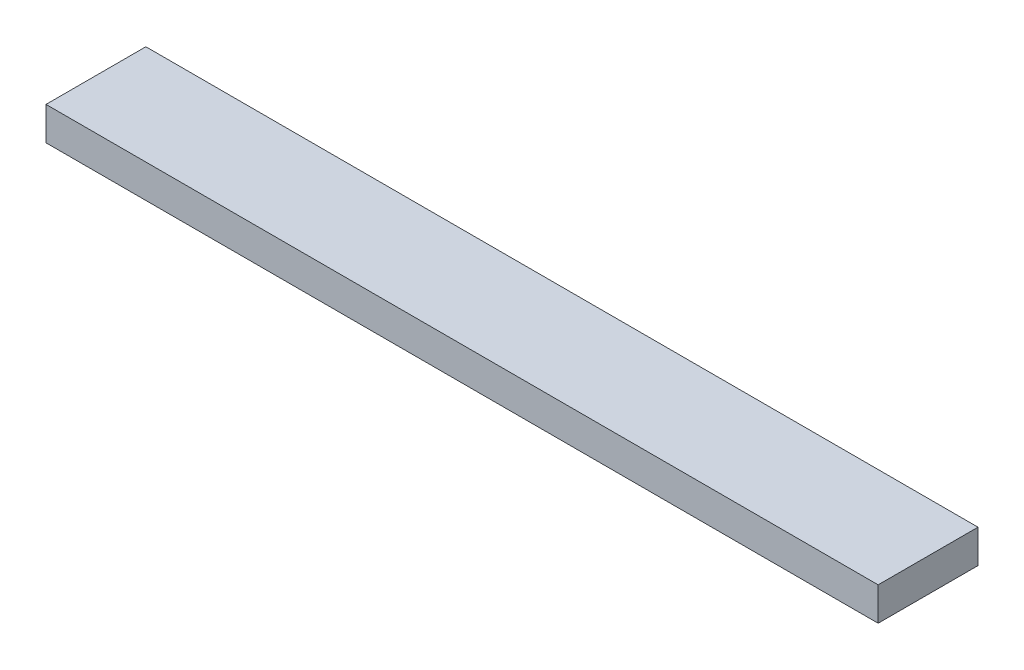
ISO-10303-21;
HEADER;
FILE_DESCRIPTION(('STEP AP214'),'2;1');
FILE_NAME('part.step','',(''),(''),'','','');
FILE_SCHEMA(('AUTOMOTIVE_DESIGN { 1 0 10303 214 1 1 1 1 }'));
ENDSEC;
DATA;
#1=APPLICATION_CONTEXT('core data for automotive mechanical design processes');
#2=APPLICATION_PROTOCOL_DEFINITION('international standard','automotive_design',2000,#1);
#3=PRODUCT_CONTEXT('',#1,'mechanical');
#4=PRODUCT('Part','Part','',(#3));
#5=PRODUCT_RELATED_PRODUCT_CATEGORY('part','',(#4));
#6=PRODUCT_DEFINITION_FORMATION('','',#4);
#7=PRODUCT_DEFINITION_CONTEXT('part definition',#1,'design');
#8=PRODUCT_DEFINITION('design','',#6,#7);
#9=PRODUCT_DEFINITION_SHAPE('','',#8);
#10=(LENGTH_UNIT() NAMED_UNIT(*) SI_UNIT(.MILLI.,.METRE.));
#11=(NAMED_UNIT(*) PLANE_ANGLE_UNIT() SI_UNIT($,.RADIAN.));
#12=(NAMED_UNIT(*) SI_UNIT($,.STERADIAN.) SOLID_ANGLE_UNIT());
#13=UNCERTAINTY_MEASURE_WITH_UNIT(LENGTH_MEASURE(1.E-05),#10,'distance_accuracy_value','');
#14=(GEOMETRIC_REPRESENTATION_CONTEXT(3) GLOBAL_UNCERTAINTY_ASSIGNED_CONTEXT((#13)) GLOBAL_UNIT_ASSIGNED_CONTEXT((#10,
#11,#12)) REPRESENTATION_CONTEXT('',''));
#15=CARTESIAN_POINT('',(0.,0.,0.));
#16=DIRECTION('',(0.,0.,1.));
#17=DIRECTION('',(1.,0.,0.));
#18=AXIS2_PLACEMENT_3D('',#15,#16,#17);
#19=CARTESIAN_POINT('',(250.,20.,30.));
#20=DIRECTION('',(-1.,0.,0.));
#21=DIRECTION('',(0.,0.,1.));
#22=AXIS2_PLACEMENT_3D('',#19,#20,#21);
#23=PLANE('',#22);
#24=DIRECTION('',(0.,0.,-1.));
#25=VECTOR('',#24,1.);
#26=CARTESIAN_POINT('',(250.,0.,30.));
#27=LINE('',#26,#25);
#28=CARTESIAN_POINT('',(250.,0.,30.));
#29=VERTEX_POINT('',#28);
#30=CARTESIAN_POINT('',(250.,0.,-30.));
#31=VERTEX_POINT('',#30);
#32=EDGE_CURVE('E98',#29,#31,#27,.T.);
#33=ORIENTED_EDGE('',*,*,#32,.T.);
#34=DIRECTION('',(0.,-1.,0.));
#35=VECTOR('',#34,1.);
#36=CARTESIAN_POINT('',(250.,20.,-30.));
#37=LINE('',#36,#35);
#38=CARTESIAN_POINT('',(250.,20.,-30.));
#39=VERTEX_POINT('',#38);
#40=EDGE_CURVE('E11',#39,#31,#37,.T.);
#41=ORIENTED_EDGE('',*,*,#40,.F.);
#42=DIRECTION('',(0.,0.,-1.));
#43=VECTOR('',#42,1.);
#44=CARTESIAN_POINT('',(250.,20.,30.));
#45=LINE('',#44,#43);
#46=CARTESIAN_POINT('',(250.,20.,30.));
#47=VERTEX_POINT('',#46);
#48=EDGE_CURVE('E86',#47,#39,#45,.T.);
#49=ORIENTED_EDGE('',*,*,#48,.F.);
#50=DIRECTION('',(0.,-1.,0.));
#51=VECTOR('',#50,1.);
#52=CARTESIAN_POINT('',(250.,20.,30.));
#53=LINE('',#52,#51);
#54=EDGE_CURVE('E94',#47,#29,#53,.T.);
#55=ORIENTED_EDGE('',*,*,#54,.T.);
#56=EDGE_LOOP('',(#33,#41,#49,#55));
#57=FACE_BOUND('',#56,.T.);
#58=ADVANCED_FACE('F35',(#57),#23,.F.);
#59=CARTESIAN_POINT('',(-250.,20.,-30.));
#60=DIRECTION('',(0.,0.,1.));
#61=DIRECTION('',(1.,0.,0.));
#62=AXIS2_PLACEMENT_3D('',#59,#60,#61);
#63=PLANE('',#62);
#64=DIRECTION('',(-1.,0.,0.));
#65=VECTOR('',#64,1.);
#66=CARTESIAN_POINT('',(-250.,0.,-30.));
#67=LINE('',#66,#65);
#68=CARTESIAN_POINT('',(-250.,0.,-30.));
#69=VERTEX_POINT('',#68);
#70=EDGE_CURVE('E90',#31,#69,#67,.T.);
#71=ORIENTED_EDGE('',*,*,#70,.T.);
#72=DIRECTION('',(0.,-1.,0.));
#73=VECTOR('',#72,1.);
#74=CARTESIAN_POINT('',(-250.,20.,-30.));
#75=LINE('',#74,#73);
#76=CARTESIAN_POINT('',(-250.,20.,-30.));
#77=VERTEX_POINT('',#76);
#78=EDGE_CURVE('E43',#77,#69,#75,.T.);
#79=ORIENTED_EDGE('',*,*,#78,.F.);
#80=DIRECTION('',(-1.,0.,0.));
#81=VECTOR('',#80,1.);
#82=CARTESIAN_POINT('',(-250.,20.,-30.));
#83=LINE('',#82,#81);
#84=EDGE_CURVE('E81',#39,#77,#83,.T.);
#85=ORIENTED_EDGE('',*,*,#84,.F.);
#86=ORIENTED_EDGE('',*,*,#40,.T.);
#87=EDGE_LOOP('',(#71,#79,#85,#86));
#88=FACE_BOUND('',#87,.T.);
#89=ADVANCED_FACE('F89',(#88),#63,.F.);
#90=CARTESIAN_POINT('',(-250.,20.,30.));
#91=DIRECTION('',(1.,0.,0.));
#92=DIRECTION('',(0.,0.,-1.));
#93=AXIS2_PLACEMENT_3D('',#90,#91,#92);
#94=PLANE('',#93);
#95=DIRECTION('',(0.,0.,1.));
#96=VECTOR('',#95,1.);
#97=CARTESIAN_POINT('',(-250.,0.,30.));
#98=LINE('',#97,#96);
#99=CARTESIAN_POINT('',(-250.,0.,30.));
#100=VERTEX_POINT('',#99);
#101=EDGE_CURVE('E68',#69,#100,#98,.T.);
#102=ORIENTED_EDGE('',*,*,#101,.T.);
#103=DIRECTION('',(0.,-1.,0.));
#104=VECTOR('',#103,1.);
#105=CARTESIAN_POINT('',(-250.,20.,30.));
#106=LINE('',#105,#104);
#107=CARTESIAN_POINT('',(-250.,20.,30.));
#108=VERTEX_POINT('',#107);
#109=EDGE_CURVE('E91',#108,#100,#106,.T.);
#110=ORIENTED_EDGE('',*,*,#109,.F.);
#111=DIRECTION('',(0.,0.,1.));
#112=VECTOR('',#111,1.);
#113=CARTESIAN_POINT('',(-250.,20.,30.));
#114=LINE('',#113,#112);
#115=EDGE_CURVE('E84',#77,#108,#114,.T.);
#116=ORIENTED_EDGE('',*,*,#115,.F.);
#117=ORIENTED_EDGE('',*,*,#78,.T.);
#118=EDGE_LOOP('',(#102,#110,#116,#117));
#119=FACE_BOUND('',#118,.T.);
#120=ADVANCED_FACE('F92',(#119),#94,.F.);
#121=CARTESIAN_POINT('',(-250.,20.,30.));
#122=DIRECTION('',(0.,0.,-1.));
#123=DIRECTION('',(-1.,0.,0.));
#124=AXIS2_PLACEMENT_3D('',#121,#122,#123);
#125=PLANE('',#124);
#126=DIRECTION('',(1.,0.,0.));
#127=VECTOR('',#126,1.);
#128=CARTESIAN_POINT('',(-250.,0.,30.));
#129=LINE('',#128,#127);
#130=EDGE_CURVE('E74',#100,#29,#129,.T.);
#131=ORIENTED_EDGE('',*,*,#130,.T.);
#132=ORIENTED_EDGE('',*,*,#54,.F.);
#133=DIRECTION('',(1.,0.,0.));
#134=VECTOR('',#133,1.);
#135=CARTESIAN_POINT('',(-250.,20.,30.));
#136=LINE('',#135,#134);
#137=EDGE_CURVE('E51',#108,#47,#136,.T.);
#138=ORIENTED_EDGE('',*,*,#137,.F.);
#139=ORIENTED_EDGE('',*,*,#109,.T.);
#140=EDGE_LOOP('',(#131,#132,#138,#139));
#141=FACE_BOUND('',#140,.T.);
#142=ADVANCED_FACE('F105',(#141),#125,.F.);
#143=CARTESIAN_POINT('',(0.,20.,0.));
#144=DIRECTION('',(0.,-1.,0.));
#145=DIRECTION('',(0.,0.,-1.));
#146=AXIS2_PLACEMENT_3D('',#143,#144,#145);
#147=PLANE('',#146);
#148=ORIENTED_EDGE('',*,*,#48,.T.);
#149=ORIENTED_EDGE('',*,*,#84,.T.);
#150=ORIENTED_EDGE('',*,*,#115,.T.);
#151=ORIENTED_EDGE('',*,*,#137,.T.);
#152=EDGE_LOOP('',(#148,#149,#150,#151));
#153=FACE_BOUND('',#152,.T.);
#154=ADVANCED_FACE('F82',(#153),#147,.F.);
#155=CARTESIAN_POINT('',(0.,0.,0.));
#156=DIRECTION('',(0.,-1.,0.));
#157=DIRECTION('',(0.,0.,-1.));
#158=AXIS2_PLACEMENT_3D('',#155,#156,#157);
#159=PLANE('',#158);
#160=ORIENTED_EDGE('',*,*,#32,.F.);
#161=ORIENTED_EDGE('',*,*,#130,.F.);
#162=ORIENTED_EDGE('',*,*,#101,.F.);
#163=ORIENTED_EDGE('',*,*,#70,.F.);
#164=EDGE_LOOP('',(#160,#161,#162,#163));
#165=FACE_BOUND('',#164,.T.);
#166=ADVANCED_FACE('F108',(#165),#159,.T.);
#167=CLOSED_SHELL('',(#58,#89,#120,#142,#154,#166));
#168=MANIFOLD_SOLID_BREP('B2',#167);
#169=ADVANCED_BREP_SHAPE_REPRESENTATION('',(#18,#168),#14);
#170=SHAPE_DEFINITION_REPRESENTATION(#9,#169);
ENDSEC;
END-ISO-10303-21;
